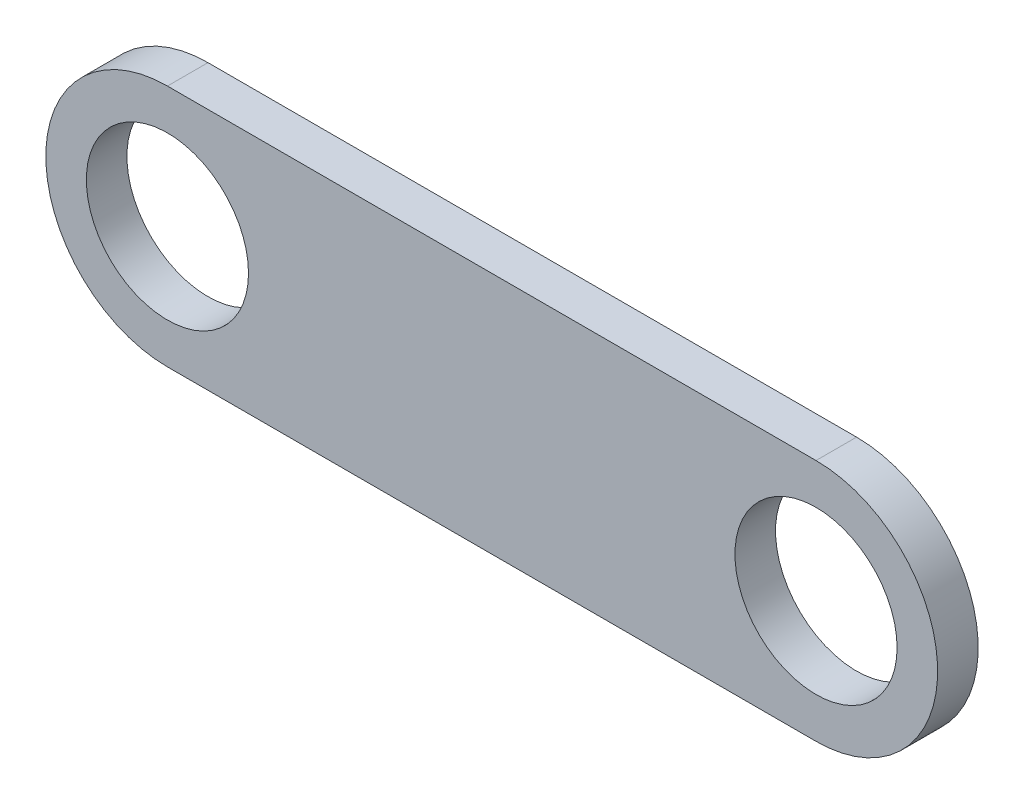
ISO-10303-21;
HEADER;
FILE_DESCRIPTION(('STEP AP214'),'2;1');
FILE_NAME('part.step','',(''),(''),'','','');
FILE_SCHEMA(('AUTOMOTIVE_DESIGN { 1 0 10303 214 1 1 1 1 }'));
ENDSEC;
DATA;
#1=APPLICATION_CONTEXT('core data for automotive mechanical design processes');
#2=APPLICATION_PROTOCOL_DEFINITION('international standard','automotive_design',2000,#1);
#3=PRODUCT_CONTEXT('',#1,'mechanical');
#4=PRODUCT('Part','Part','',(#3));
#5=PRODUCT_RELATED_PRODUCT_CATEGORY('part','',(#4));
#6=PRODUCT_DEFINITION_FORMATION('','',#4);
#7=PRODUCT_DEFINITION_CONTEXT('part definition',#1,'design');
#8=PRODUCT_DEFINITION('design','',#6,#7);
#9=PRODUCT_DEFINITION_SHAPE('','',#8);
#10=(LENGTH_UNIT() NAMED_UNIT(*) SI_UNIT(.MILLI.,.METRE.));
#11=(NAMED_UNIT(*) PLANE_ANGLE_UNIT() SI_UNIT($,.RADIAN.));
#12=(NAMED_UNIT(*) SI_UNIT($,.STERADIAN.) SOLID_ANGLE_UNIT());
#13=UNCERTAINTY_MEASURE_WITH_UNIT(LENGTH_MEASURE(1.E-05),#10,'distance_accuracy_value','');
#14=(GEOMETRIC_REPRESENTATION_CONTEXT(3) GLOBAL_UNCERTAINTY_ASSIGNED_CONTEXT((#13)) GLOBAL_UNIT_ASSIGNED_CONTEXT((#10,
#11,#12)) REPRESENTATION_CONTEXT('',''));
#15=CARTESIAN_POINT('',(0.,0.,0.));
#16=DIRECTION('',(0.,0.,1.));
#17=DIRECTION('',(1.,0.,0.));
#18=AXIS2_PLACEMENT_3D('',#15,#16,#17);
#19=CARTESIAN_POINT('',(-28.7628865979381,-3.86597938144329,5.));
#20=DIRECTION('',(0.,0.,1.));
#21=DIRECTION('',(1.,0.,0.));
#22=AXIS2_PLACEMENT_3D('',#19,#20,#21);
#23=PLANE('',#22);
#24=CARTESIAN_POINT('',(-28.7628865979381,-3.86597938144329,5.));
#25=DIRECTION('',(0.,0.,1.));
#26=DIRECTION('',(1.,0.,0.));
#27=AXIS2_PLACEMENT_3D('',#24,#25,#26);
#28=CIRCLE('',#27,10.);
#29=CARTESIAN_POINT('',(-18.7628865979381,-3.86597938144329,5.));
#30=VERTEX_POINT('',#29);
#31=EDGE_CURVE('E118',#30,#30,#28,.T.);
#32=ORIENTED_EDGE('',*,*,#31,.F.);
#33=EDGE_LOOP('',(#32));
#34=FACE_BOUND('',#33,.T.);
#35=CARTESIAN_POINT('',(-28.7628865979381,-3.86597938144329,5.));
#36=DIRECTION('',(0.,0.,1.));
#37=DIRECTION('',(1.,0.,0.));
#38=AXIS2_PLACEMENT_3D('',#35,#36,#37);
#39=CIRCLE('',#38,15.);
#40=CARTESIAN_POINT('',(-28.7628865979381,11.1340206185567,5.));
#41=VERTEX_POINT('',#40);
#42=CARTESIAN_POINT('',(-28.7628865979381,-18.8659793814433,5.));
#43=VERTEX_POINT('',#42);
#44=EDGE_CURVE('E98',#41,#43,#39,.T.);
#45=ORIENTED_EDGE('',*,*,#44,.T.);
#46=DIRECTION('',(1.,0.,0.));
#47=VECTOR('',#46,1.);
#48=CARTESIAN_POINT('',(-28.7628865979381,-18.8659793814433,5.));
#49=LINE('',#48,#47);
#50=CARTESIAN_POINT('',(51.2371134020619,-18.8659793814433,5.));
#51=VERTEX_POINT('',#50);
#52=EDGE_CURVE('E93',#43,#51,#49,.T.);
#53=ORIENTED_EDGE('',*,*,#52,.T.);
#54=CARTESIAN_POINT('',(51.2371134020619,-3.86597938144329,5.));
#55=DIRECTION('',(0.,0.,1.));
#56=DIRECTION('',(1.,0.,0.));
#57=AXIS2_PLACEMENT_3D('',#54,#55,#56);
#58=CIRCLE('',#57,15.);
#59=CARTESIAN_POINT('',(51.2371134020619,11.1340206185567,5.));
#60=VERTEX_POINT('',#59);
#61=EDGE_CURVE('E96',#51,#60,#58,.T.);
#62=ORIENTED_EDGE('',*,*,#61,.T.);
#63=DIRECTION('',(-1.,0.,0.));
#64=VECTOR('',#63,1.);
#65=CARTESIAN_POINT('',(-28.7628865979381,11.1340206185567,5.));
#66=LINE('',#65,#64);
#67=EDGE_CURVE('E63',#60,#41,#66,.T.);
#68=ORIENTED_EDGE('',*,*,#67,.T.);
#69=EDGE_LOOP('',(#45,#53,#62,#68));
#70=FACE_BOUND('',#69,.T.);
#71=CARTESIAN_POINT('',(51.2371134020619,-3.86597938144329,5.));
#72=DIRECTION('',(0.,0.,1.));
#73=DIRECTION('',(1.,0.,0.));
#74=AXIS2_PLACEMENT_3D('',#71,#72,#73);
#75=CIRCLE('',#74,10.);
#76=CARTESIAN_POINT('',(61.2371134020619,-3.86597938144329,5.));
#77=VERTEX_POINT('',#76);
#78=EDGE_CURVE('E140',#77,#77,#75,.T.);
#79=ORIENTED_EDGE('',*,*,#78,.F.);
#80=EDGE_LOOP('',(#79));
#81=FACE_BOUND('',#80,.T.);
#82=ADVANCED_FACE('F45',(#34,#70,#81),#23,.T.);
#83=CARTESIAN_POINT('',(-28.7628865979381,-3.86597938144329,0.));
#84=DIRECTION('',(0.,0.,1.));
#85=DIRECTION('',(1.,0.,0.));
#86=AXIS2_PLACEMENT_3D('',#83,#84,#85);
#87=PLANE('',#86);
#88=CARTESIAN_POINT('',(-28.7628865979381,-3.86597938144329,0.));
#89=DIRECTION('',(0.,0.,1.));
#90=DIRECTION('',(1.,0.,0.));
#91=AXIS2_PLACEMENT_3D('',#88,#89,#90);
#92=CIRCLE('',#91,15.);
#93=CARTESIAN_POINT('',(-28.7628865979381,11.1340206185567,0.));
#94=VERTEX_POINT('',#93);
#95=CARTESIAN_POINT('',(-28.7628865979381,-18.8659793814433,0.));
#96=VERTEX_POINT('',#95);
#97=EDGE_CURVE('E114',#94,#96,#92,.T.);
#98=ORIENTED_EDGE('',*,*,#97,.F.);
#99=DIRECTION('',(-1.,0.,0.));
#100=VECTOR('',#99,1.);
#101=CARTESIAN_POINT('',(-28.7628865979381,11.1340206185567,0.));
#102=LINE('',#101,#100);
#103=CARTESIAN_POINT('',(51.2371134020619,11.1340206185567,0.));
#104=VERTEX_POINT('',#103);
#105=EDGE_CURVE('E86',#104,#94,#102,.T.);
#106=ORIENTED_EDGE('',*,*,#105,.F.);
#107=CARTESIAN_POINT('',(51.2371134020619,-3.86597938144329,0.));
#108=DIRECTION('',(0.,0.,1.));
#109=DIRECTION('',(1.,0.,0.));
#110=AXIS2_PLACEMENT_3D('',#107,#108,#109);
#111=CIRCLE('',#110,15.);
#112=CARTESIAN_POINT('',(51.2371134020619,-18.8659793814433,0.));
#113=VERTEX_POINT('',#112);
#114=EDGE_CURVE('E80',#113,#104,#111,.T.);
#115=ORIENTED_EDGE('',*,*,#114,.F.);
#116=DIRECTION('',(1.,0.,0.));
#117=VECTOR('',#116,1.);
#118=CARTESIAN_POINT('',(-28.7628865979381,-18.8659793814433,0.));
#119=LINE('',#118,#117);
#120=EDGE_CURVE('E103',#96,#113,#119,.T.);
#121=ORIENTED_EDGE('',*,*,#120,.F.);
#122=EDGE_LOOP('',(#98,#106,#115,#121));
#123=FACE_BOUND('',#122,.T.);
#124=CARTESIAN_POINT('',(-28.7628865979381,-3.86597938144329,0.));
#125=DIRECTION('',(0.,0.,1.));
#126=DIRECTION('',(1.,0.,0.));
#127=AXIS2_PLACEMENT_3D('',#124,#125,#126);
#128=CIRCLE('',#127,10.);
#129=CARTESIAN_POINT('',(-18.7628865979381,-3.86597938144329,0.));
#130=VERTEX_POINT('',#129);
#131=EDGE_CURVE('E136',#130,#130,#128,.T.);
#132=ORIENTED_EDGE('',*,*,#131,.T.);
#133=EDGE_LOOP('',(#132));
#134=FACE_BOUND('',#133,.T.);
#135=CARTESIAN_POINT('',(51.2371134020619,-3.86597938144329,0.));
#136=DIRECTION('',(0.,0.,1.));
#137=DIRECTION('',(1.,0.,0.));
#138=AXIS2_PLACEMENT_3D('',#135,#136,#137);
#139=CIRCLE('',#138,10.);
#140=CARTESIAN_POINT('',(61.2371134020619,-3.86597938144329,0.));
#141=VERTEX_POINT('',#140);
#142=EDGE_CURVE('E144',#141,#141,#139,.T.);
#143=ORIENTED_EDGE('',*,*,#142,.T.);
#144=EDGE_LOOP('',(#143));
#145=FACE_BOUND('',#144,.T.);
#146=ADVANCED_FACE('F131',(#123,#134,#145),#87,.F.);
#147=CARTESIAN_POINT('',(-28.7628865979381,-3.86597938144329,5.));
#148=DIRECTION('',(0.,0.,-1.));
#149=DIRECTION('',(-1.,0.,0.));
#150=AXIS2_PLACEMENT_3D('',#147,#148,#149);
#151=CYLINDRICAL_SURFACE('',#150,15.);
#152=ORIENTED_EDGE('',*,*,#97,.T.);
#153=DIRECTION('',(0.,0.,-1.));
#154=VECTOR('',#153,1.);
#155=CARTESIAN_POINT('',(-28.7628865979381,-18.8659793814433,5.));
#156=LINE('',#155,#154);
#157=EDGE_CURVE('E11',#43,#96,#156,.T.);
#158=ORIENTED_EDGE('',*,*,#157,.F.);
#159=ORIENTED_EDGE('',*,*,#44,.F.);
#160=DIRECTION('',(0.,0.,-1.));
#161=VECTOR('',#160,1.);
#162=CARTESIAN_POINT('',(-28.7628865979381,11.1340206185567,5.));
#163=LINE('',#162,#161);
#164=EDGE_CURVE('E110',#41,#94,#163,.T.);
#165=ORIENTED_EDGE('',*,*,#164,.T.);
#166=EDGE_LOOP('',(#152,#158,#159,#165));
#167=FACE_BOUND('',#166,.T.);
#168=ADVANCED_FACE('F47',(#167),#151,.T.);
#169=CARTESIAN_POINT('',(-28.7628865979381,-18.8659793814433,5.));
#170=DIRECTION('',(0.,1.,0.));
#171=DIRECTION('',(0.,0.,1.));
#172=AXIS2_PLACEMENT_3D('',#169,#170,#171);
#173=PLANE('',#172);
#174=ORIENTED_EDGE('',*,*,#120,.T.);
#175=DIRECTION('',(0.,0.,-1.));
#176=VECTOR('',#175,1.);
#177=CARTESIAN_POINT('',(51.2371134020619,-18.8659793814433,5.));
#178=LINE('',#177,#176);
#179=EDGE_CURVE('E55',#51,#113,#178,.T.);
#180=ORIENTED_EDGE('',*,*,#179,.F.);
#181=ORIENTED_EDGE('',*,*,#52,.F.);
#182=ORIENTED_EDGE('',*,*,#157,.T.);
#183=EDGE_LOOP('',(#174,#180,#181,#182));
#184=FACE_BOUND('',#183,.T.);
#185=ADVANCED_FACE('F102',(#184),#173,.F.);
#186=CARTESIAN_POINT('',(51.2371134020619,-3.86597938144329,5.));
#187=DIRECTION('',(0.,0.,-1.));
#188=DIRECTION('',(-1.,0.,0.));
#189=AXIS2_PLACEMENT_3D('',#186,#187,#188);
#190=CYLINDRICAL_SURFACE('',#189,15.);
#191=ORIENTED_EDGE('',*,*,#114,.T.);
#192=DIRECTION('',(0.,0.,-1.));
#193=VECTOR('',#192,1.);
#194=CARTESIAN_POINT('',(51.2371134020619,11.1340206185567,5.));
#195=LINE('',#194,#193);
#196=EDGE_CURVE('E105',#60,#104,#195,.T.);
#197=ORIENTED_EDGE('',*,*,#196,.F.);
#198=ORIENTED_EDGE('',*,*,#61,.F.);
#199=ORIENTED_EDGE('',*,*,#179,.T.);
#200=EDGE_LOOP('',(#191,#197,#198,#199));
#201=FACE_BOUND('',#200,.T.);
#202=ADVANCED_FACE('F106',(#201),#190,.T.);
#203=CARTESIAN_POINT('',(-28.7628865979381,11.1340206185567,5.));
#204=DIRECTION('',(0.,-1.,0.));
#205=DIRECTION('',(0.,0.,-1.));
#206=AXIS2_PLACEMENT_3D('',#203,#204,#205);
#207=PLANE('',#206);
#208=ORIENTED_EDGE('',*,*,#105,.T.);
#209=ORIENTED_EDGE('',*,*,#164,.F.);
#210=ORIENTED_EDGE('',*,*,#67,.F.);
#211=ORIENTED_EDGE('',*,*,#196,.T.);
#212=EDGE_LOOP('',(#208,#209,#210,#211));
#213=FACE_BOUND('',#212,.T.);
#214=ADVANCED_FACE('F128',(#213),#207,.F.);
#215=CARTESIAN_POINT('',(-28.7628865979381,-3.86597938144329,5.));
#216=DIRECTION('',(0.,0.,-1.));
#217=DIRECTION('',(-1.,0.,0.));
#218=AXIS2_PLACEMENT_3D('',#215,#216,#217);
#219=CYLINDRICAL_SURFACE('',#218,10.);
#220=ORIENTED_EDGE('',*,*,#31,.T.);
#221=EDGE_LOOP('',(#220));
#222=FACE_BOUND('',#221,.T.);
#223=ORIENTED_EDGE('',*,*,#131,.F.);
#224=EDGE_LOOP('',(#223));
#225=FACE_BOUND('',#224,.T.);
#226=ADVANCED_FACE('F163',(#222,#225),#219,.F.);
#227=CARTESIAN_POINT('',(51.2371134020619,-3.86597938144329,5.));
#228=DIRECTION('',(0.,0.,-1.));
#229=DIRECTION('',(-1.,0.,0.));
#230=AXIS2_PLACEMENT_3D('',#227,#228,#229);
#231=CYLINDRICAL_SURFACE('',#230,10.);
#232=ORIENTED_EDGE('',*,*,#78,.T.);
#233=EDGE_LOOP('',(#232));
#234=FACE_BOUND('',#233,.T.);
#235=ORIENTED_EDGE('',*,*,#142,.F.);
#236=EDGE_LOOP('',(#235));
#237=FACE_BOUND('',#236,.T.);
#238=ADVANCED_FACE('F152',(#234,#237),#231,.F.);
#239=CLOSED_SHELL('',(#82,#146,#168,#185,#202,#214,#226,#238));
#240=MANIFOLD_SOLID_BREP('B2',#239);
#241=ADVANCED_BREP_SHAPE_REPRESENTATION('',(#18,#240),#14);
#242=SHAPE_DEFINITION_REPRESENTATION(#9,#241);
ENDSEC;
END-ISO-10303-21;
